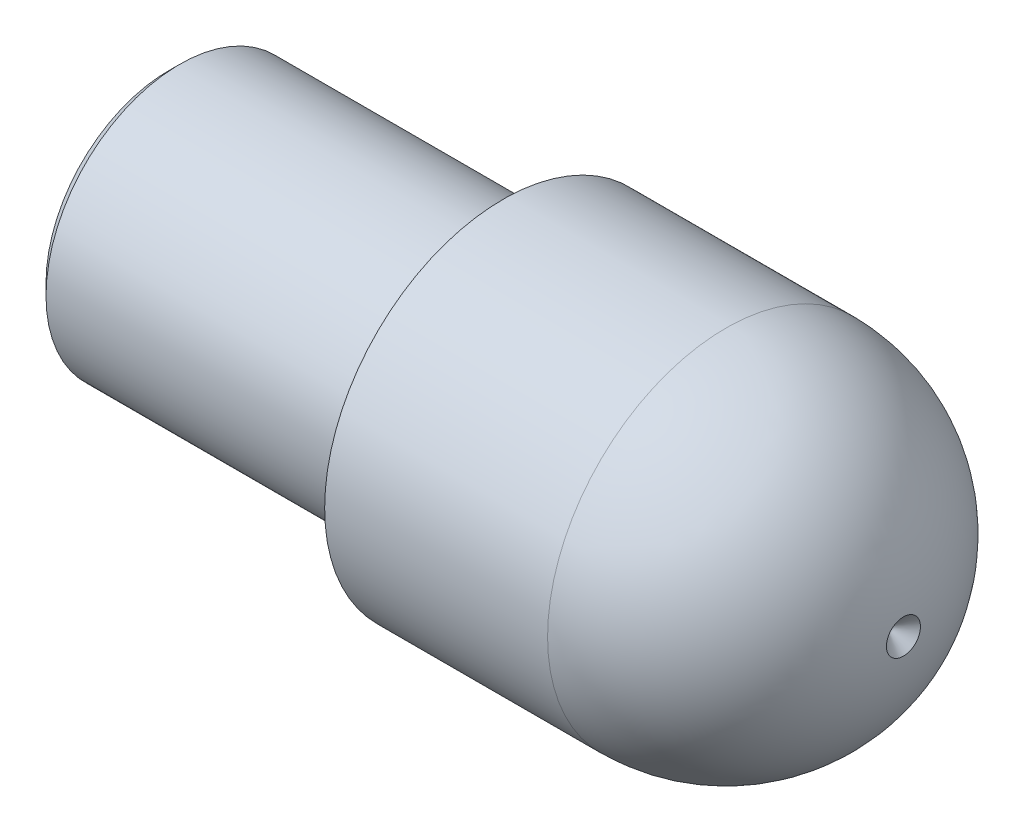
ISO-10303-21;
HEADER;
FILE_DESCRIPTION(('STEP AP214'),'2;1');
FILE_NAME('part.step','',(''),(''),'','','');
FILE_SCHEMA(('AUTOMOTIVE_DESIGN { 1 0 10303 214 1 1 1 1 }'));
ENDSEC;
DATA;
#1=APPLICATION_CONTEXT('core data for automotive mechanical design processes');
#2=APPLICATION_PROTOCOL_DEFINITION('international standard','automotive_design',2000,#1);
#3=PRODUCT_CONTEXT('',#1,'mechanical');
#4=PRODUCT('Part','Part','',(#3));
#5=PRODUCT_RELATED_PRODUCT_CATEGORY('part','',(#4));
#6=PRODUCT_DEFINITION_FORMATION('','',#4);
#7=PRODUCT_DEFINITION_CONTEXT('part definition',#1,'design');
#8=PRODUCT_DEFINITION('design','',#6,#7);
#9=PRODUCT_DEFINITION_SHAPE('','',#8);
#10=(LENGTH_UNIT() NAMED_UNIT(*) SI_UNIT(.MILLI.,.METRE.));
#11=(NAMED_UNIT(*) PLANE_ANGLE_UNIT() SI_UNIT($,.RADIAN.));
#12=(NAMED_UNIT(*) SI_UNIT($,.STERADIAN.) SOLID_ANGLE_UNIT());
#13=UNCERTAINTY_MEASURE_WITH_UNIT(LENGTH_MEASURE(1.E-05),#10,'distance_accuracy_value','');
#14=(GEOMETRIC_REPRESENTATION_CONTEXT(3) GLOBAL_UNCERTAINTY_ASSIGNED_CONTEXT((#13)) GLOBAL_UNIT_ASSIGNED_CONTEXT((#10,
#11,#12)) REPRESENTATION_CONTEXT('',''));
#15=CARTESIAN_POINT('',(0.,0.,0.));
#16=DIRECTION('',(0.,0.,1.));
#17=DIRECTION('',(1.,0.,0.));
#18=AXIS2_PLACEMENT_3D('',#15,#16,#17);
#19=CARTESIAN_POINT('',(-14.567,0.,0.));
#20=DIRECTION('',(-1.,0.,0.));
#21=DIRECTION('',(0.,0.,1.));
#22=AXIS2_PLACEMENT_3D('',#19,#20,#21);
#23=CONICAL_SURFACE('',#22,2.067,0.785398163397449);
#24=CARTESIAN_POINT('',(-15.,0.,0.));
#25=DIRECTION('',(-1.,0.,0.));
#26=DIRECTION('',(0.,0.,1.));
#27=AXIS2_PLACEMENT_3D('',#24,#25,#26);
#28=CIRCLE('',#27,2.5);
#29=CARTESIAN_POINT('',(-15.,0.,2.5));
#30=VERTEX_POINT('',#29);
#31=EDGE_CURVE('E70',#30,#30,#28,.T.);
#32=ORIENTED_EDGE('',*,*,#31,.T.);
#33=EDGE_LOOP('',(#32));
#34=FACE_BOUND('',#33,.T.);
#35=CARTESIAN_POINT('',(-14.65,0.,0.));
#36=DIRECTION('',(-1.,0.,0.));
#37=DIRECTION('',(0.,0.,1.));
#38=AXIS2_PLACEMENT_3D('',#35,#36,#37);
#39=CIRCLE('',#38,2.15);
#40=CARTESIAN_POINT('',(-14.65,0.,2.15));
#41=VERTEX_POINT('',#40);
#42=EDGE_CURVE('E35',#41,#41,#39,.F.);
#43=ORIENTED_EDGE('',*,*,#42,.T.);
#44=EDGE_LOOP('',(#43));
#45=FACE_BOUND('',#44,.T.);
#46=ADVANCED_FACE('F31',(#34,#45),#23,.F.);
#47=CARTESIAN_POINT('',(0.1,0.,0.));
#48=DIRECTION('',(-1.,0.,0.));
#49=DIRECTION('',(0.,0.,1.));
#50=AXIS2_PLACEMENT_3D('',#47,#48,#49);
#51=CYLINDRICAL_SURFACE('',#50,6.);
#52=CARTESIAN_POINT('',(-14.5,0.,0.));
#53=DIRECTION('',(-1.,0.,0.));
#54=DIRECTION('',(0.,0.,1.));
#55=AXIS2_PLACEMENT_3D('',#52,#53,#54);
#56=CIRCLE('',#55,6.);
#57=CARTESIAN_POINT('',(-14.5,0.,6.));
#58=VERTEX_POINT('',#57);
#59=EDGE_CURVE('E40',#58,#58,#56,.T.);
#60=ORIENTED_EDGE('',*,*,#59,.F.);
#61=EDGE_LOOP('',(#60));
#62=FACE_BOUND('',#61,.T.);
#63=CARTESIAN_POINT('',(-1.,0.,0.));
#64=DIRECTION('',(-1.,0.,0.));
#65=DIRECTION('',(0.,0.,1.));
#66=AXIS2_PLACEMENT_3D('',#63,#64,#65);
#67=CIRCLE('',#66,6.);
#68=CARTESIAN_POINT('',(-1.,0.,6.));
#69=VERTEX_POINT('',#68);
#70=EDGE_CURVE('E57',#69,#69,#67,.T.);
#71=ORIENTED_EDGE('',*,*,#70,.T.);
#72=EDGE_LOOP('',(#71));
#73=FACE_BOUND('',#72,.T.);
#74=ADVANCED_FACE('F87',(#62,#73),#51,.T.);
#75=CARTESIAN_POINT('',(-15.,1.2,0.));
#76=DIRECTION('',(1.,0.,0.));
#77=DIRECTION('',(0.,0.,-1.));
#78=AXIS2_PLACEMENT_3D('',#75,#76,#77);
#79=PLANE('',#78);
#80=CARTESIAN_POINT('',(-15.,0.,0.));
#81=DIRECTION('',(-1.,0.,0.));
#82=DIRECTION('',(0.,0.,1.));
#83=AXIS2_PLACEMENT_3D('',#80,#81,#82);
#84=CIRCLE('',#83,5.5);
#85=CARTESIAN_POINT('',(-15.,0.,5.5));
#86=VERTEX_POINT('',#85);
#87=EDGE_CURVE('E11',#86,#86,#84,.T.);
#88=ORIENTED_EDGE('',*,*,#87,.T.);
#89=EDGE_LOOP('',(#88));
#90=FACE_BOUND('',#89,.T.);
#91=ORIENTED_EDGE('',*,*,#31,.F.);
#92=EDGE_LOOP('',(#91));
#93=FACE_BOUND('',#92,.T.);
#94=ADVANCED_FACE('F33',(#90,#93),#79,.F.);
#95=CARTESIAN_POINT('',(-14.5,0.,0.));
#96=DIRECTION('',(1.,0.,0.));
#97=DIRECTION('',(0.,0.,-1.));
#98=AXIS2_PLACEMENT_3D('',#95,#96,#97);
#99=CONICAL_SURFACE('',#98,6.,0.78539816339745);
#100=ORIENTED_EDGE('',*,*,#87,.F.);
#101=EDGE_LOOP('',(#100));
#102=FACE_BOUND('',#101,.T.);
#103=ORIENTED_EDGE('',*,*,#59,.T.);
#104=EDGE_LOOP('',(#103));
#105=FACE_BOUND('',#104,.T.);
#106=ADVANCED_FACE('F85',(#102,#105),#99,.T.);
#107=CARTESIAN_POINT('',(-0.826794919243149,0.,0.));
#108=DIRECTION('',(-1.,0.,0.));
#109=DIRECTION('',(0.,0.,1.));
#110=AXIS2_PLACEMENT_3D('',#107,#108,#109);
#111=TOROIDAL_SURFACE('',#110,6.09999999999994,0.199999999999937);
#112=CARTESIAN_POINT('',(-0.82679491924312,0.,0.));
#113=DIRECTION('',(-1.,0.,0.));
#114=DIRECTION('',(0.,0.,1.));
#115=AXIS2_PLACEMENT_3D('',#112,#113,#114);
#116=CIRCLE('',#115,5.9);
#117=CARTESIAN_POINT('',(-0.82679491924312,0.,5.9));
#118=VERTEX_POINT('',#117);
#119=EDGE_CURVE('E67',#118,#118,#116,.T.);
#120=ORIENTED_EDGE('',*,*,#119,.T.);
#121=EDGE_LOOP('',(#120));
#122=FACE_BOUND('',#121,.T.);
#123=ORIENTED_EDGE('',*,*,#70,.F.);
#124=EDGE_LOOP('',(#123));
#125=FACE_BOUND('',#124,.T.);
#126=ADVANCED_FACE('F93',(#122,#125),#111,.F.);
#127=CARTESIAN_POINT('',(0.,0.,0.));
#128=DIRECTION('',(-1.,0.,0.));
#129=DIRECTION('',(0.,0.,1.));
#130=AXIS2_PLACEMENT_3D('',#127,#128,#129);
#131=CYLINDRICAL_SURFACE('',#130,5.9);
#132=CARTESIAN_POINT('',(-0.17320508075689,0.,0.));
#133=DIRECTION('',(-1.,0.,0.));
#134=DIRECTION('',(0.,0.,1.));
#135=AXIS2_PLACEMENT_3D('',#132,#133,#134);
#136=CIRCLE('',#135,5.9);
#137=CARTESIAN_POINT('',(-0.17320508075689,0.,5.9));
#138=VERTEX_POINT('',#137);
#139=EDGE_CURVE('E64',#138,#138,#136,.T.);
#140=ORIENTED_EDGE('',*,*,#139,.T.);
#141=EDGE_LOOP('',(#140));
#142=FACE_BOUND('',#141,.T.);
#143=ORIENTED_EDGE('',*,*,#119,.F.);
#144=EDGE_LOOP('',(#143));
#145=FACE_BOUND('',#144,.T.);
#146=ADVANCED_FACE('F95',(#142,#145),#131,.T.);
#147=CARTESIAN_POINT('',(-0.17320508075685,0.,0.));
#148=DIRECTION('',(-1.,0.,0.));
#149=DIRECTION('',(0.,0.,1.));
#150=AXIS2_PLACEMENT_3D('',#147,#148,#149);
#151=TOROIDAL_SURFACE('',#150,6.09999999999993,0.199999999999934);
#152=CARTESIAN_POINT('',(0.,0.,0.));
#153=DIRECTION('',(-1.,0.,0.));
#154=DIRECTION('',(0.,0.,1.));
#155=AXIS2_PLACEMENT_3D('',#152,#153,#154);
#156=CIRCLE('',#155,6.);
#157=CARTESIAN_POINT('',(0.,0.,6.));
#158=VERTEX_POINT('',#157);
#159=EDGE_CURVE('E61',#158,#158,#156,.T.);
#160=ORIENTED_EDGE('',*,*,#159,.T.);
#161=EDGE_LOOP('',(#160));
#162=FACE_BOUND('',#161,.T.);
#163=ORIENTED_EDGE('',*,*,#139,.F.);
#164=EDGE_LOOP('',(#163));
#165=FACE_BOUND('',#164,.T.);
#166=ADVANCED_FACE('F102',(#162,#165),#151,.F.);
#167=CARTESIAN_POINT('',(17.2,0.,0.));
#168=DIRECTION('',(1.,0.,0.));
#169=DIRECTION('',(0.,0.,-1.));
#170=AXIS2_PLACEMENT_3D('',#167,#168,#169);
#171=CONICAL_SURFACE('',#170,0.,0.785398163397639);
#172=CARTESIAN_POINT('',(17.963484845854,0.,0.));
#173=DIRECTION('',(-1.,0.,0.));
#174=DIRECTION('',(0.,0.,1.));
#175=AXIS2_PLACEMENT_3D('',#172,#173,#174);
#176=CIRCLE('',#175,0.763484845854291);
#177=CARTESIAN_POINT('',(17.963484845854,0.,0.763484845854291));
#178=VERTEX_POINT('',#177);
#179=EDGE_CURVE('E73',#178,#178,#176,.T.);
#180=ORIENTED_EDGE('',*,*,#179,.F.);
#181=EDGE_LOOP('',(#180));
#182=FACE_BOUND('',#181,.T.);
#183=CARTESIAN_POINT('',(17.2,0.,0.));
#184=VERTEX_POINT('',#183);
#185=VERTEX_LOOP('',#184);
#186=FACE_BOUND('',#185,.T.);
#187=ADVANCED_FACE('F113',(#182,#186),#171,.F.);
#188=CARTESIAN_POINT('',(10.0000000000008,1.21343907144578E-12,0.));
#189=DIRECTION('',(-1.,0.,0.));
#190=DIRECTION('',(0.,1.,0.));
#191=AXIS2_PLACEMENT_3D('',#188,#189,#190);
#192=SPHERICAL_SURFACE('',#191,7.99999999999879);
#193=CARTESIAN_POINT('',(10.,0.,0.));
#194=DIRECTION('',(-1.,0.,0.));
#195=DIRECTION('',(0.,0.,1.));
#196=AXIS2_PLACEMENT_3D('',#193,#194,#195);
#197=CIRCLE('',#196,8.);
#198=CARTESIAN_POINT('',(10.,0.,8.));
#199=VERTEX_POINT('',#198);
#200=EDGE_CURVE('E76',#199,#199,#197,.T.);
#201=ORIENTED_EDGE('',*,*,#200,.F.);
#202=EDGE_LOOP('',(#201));
#203=FACE_BOUND('',#202,.T.);
#204=ORIENTED_EDGE('',*,*,#179,.T.);
#205=EDGE_LOOP('',(#204));
#206=FACE_BOUND('',#205,.T.);
#207=ADVANCED_FACE('F116',(#203,#206),#192,.T.);
#208=CARTESIAN_POINT('',(17.2,0.,0.));
#209=DIRECTION('',(-1.,0.,0.));
#210=DIRECTION('',(0.,0.,1.));
#211=AXIS2_PLACEMENT_3D('',#208,#209,#210);
#212=CYLINDRICAL_SURFACE('',#211,8.);
#213=CARTESIAN_POINT('',(0.,0.,0.));
#214=DIRECTION('',(-1.,0.,0.));
#215=DIRECTION('',(0.,0.,1.));
#216=AXIS2_PLACEMENT_3D('',#213,#214,#215);
#217=CIRCLE('',#216,8.);
#218=CARTESIAN_POINT('',(0.,0.,8.));
#219=VERTEX_POINT('',#218);
#220=EDGE_CURVE('E79',#219,#219,#217,.T.);
#221=ORIENTED_EDGE('',*,*,#220,.F.);
#222=EDGE_LOOP('',(#221));
#223=FACE_BOUND('',#222,.T.);
#224=ORIENTED_EDGE('',*,*,#200,.T.);
#225=EDGE_LOOP('',(#224));
#226=FACE_BOUND('',#225,.T.);
#227=ADVANCED_FACE('F120',(#223,#226),#212,.T.);
#228=CARTESIAN_POINT('',(0.,0.,0.));
#229=DIRECTION('',(1.,0.,0.));
#230=DIRECTION('',(0.,0.,-1.));
#231=AXIS2_PLACEMENT_3D('',#228,#229,#230);
#232=PLANE('',#231);
#233=ORIENTED_EDGE('',*,*,#159,.F.);
#234=EDGE_LOOP('',(#233));
#235=FACE_BOUND('',#234,.T.);
#236=ORIENTED_EDGE('',*,*,#220,.T.);
#237=EDGE_LOOP('',(#236));
#238=FACE_BOUND('',#237,.T.);
#239=ADVANCED_FACE('F124',(#235,#238),#232,.F.);
#240=CARTESIAN_POINT('',(-0.5,0.,0.));
#241=DIRECTION('',(-1.,0.,0.));
#242=DIRECTION('',(0.,0.,1.));
#243=AXIS2_PLACEMENT_3D('',#240,#241,#242);
#244=CYLINDRICAL_SURFACE('',#243,2.15);
#245=ORIENTED_EDGE('',*,*,#42,.F.);
#246=EDGE_LOOP('',(#245));
#247=FACE_BOUND('',#246,.T.);
#248=CARTESIAN_POINT('',(-1.7413030787577,0.,0.));
#249=DIRECTION('',(-1.,0.,0.));
#250=DIRECTION('',(0.,0.,1.));
#251=AXIS2_PLACEMENT_3D('',#248,#249,#250);
#252=CIRCLE('',#251,2.15);
#253=CARTESIAN_POINT('',(-1.7413030787577,0.,2.15));
#254=VERTEX_POINT('',#253);
#255=EDGE_CURVE('E53',#254,#254,#252,.T.);
#256=ORIENTED_EDGE('',*,*,#255,.F.);
#257=EDGE_LOOP('',(#256));
#258=FACE_BOUND('',#257,.T.);
#259=ADVANCED_FACE('F49',(#247,#258),#244,.F.);
#260=CARTESIAN_POINT('',(-0.5,0.,0.));
#261=DIRECTION('',(-1.,0.,0.));
#262=DIRECTION('',(0.,0.,1.));
#263=AXIS2_PLACEMENT_3D('',#260,#261,#262);
#264=CONICAL_SURFACE('',#263,0.,1.04719755119658);
#265=CARTESIAN_POINT('',(-0.5,0.,0.));
#266=VERTEX_POINT('',#265);
#267=VERTEX_LOOP('',#266);
#268=FACE_BOUND('',#267,.T.);
#269=ORIENTED_EDGE('',*,*,#255,.T.);
#270=EDGE_LOOP('',(#269));
#271=FACE_BOUND('',#270,.T.);
#272=ADVANCED_FACE('F46',(#268,#271),#264,.F.);
#273=CLOSED_SHELL('',(#46,#74,#94,#106,#126,#146,#166,#187,#207,#227,#239,#259,#272));
#274=MANIFOLD_SOLID_BREP('B2',#273);
#275=ADVANCED_BREP_SHAPE_REPRESENTATION('',(#18,#274),#14);
#276=SHAPE_DEFINITION_REPRESENTATION(#9,#275);
ENDSEC;
END-ISO-10303-21;
